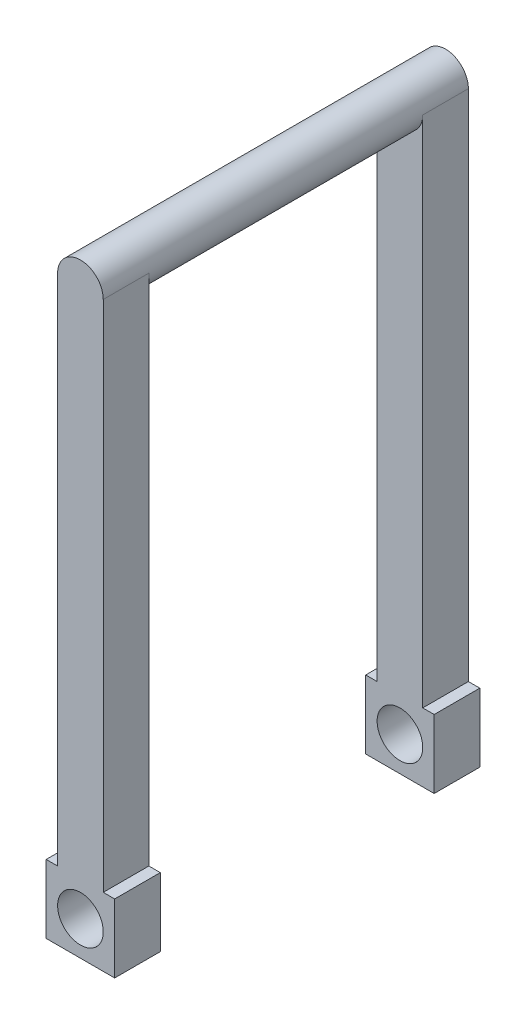
ISO-10303-21;
HEADER;
FILE_DESCRIPTION(('STEP AP214'),'2;1');
FILE_NAME('part.step','',(''),(''),'','','');
FILE_SCHEMA(('AUTOMOTIVE_DESIGN { 1 0 10303 214 1 1 1 1 }'));
ENDSEC;
DATA;
#1=APPLICATION_CONTEXT('core data for automotive mechanical design processes');
#2=APPLICATION_PROTOCOL_DEFINITION('international standard','automotive_design',2000,#1);
#3=PRODUCT_CONTEXT('',#1,'mechanical');
#4=PRODUCT('Part','Part','',(#3));
#5=PRODUCT_RELATED_PRODUCT_CATEGORY('part','',(#4));
#6=PRODUCT_DEFINITION_FORMATION('','',#4);
#7=PRODUCT_DEFINITION_CONTEXT('part definition',#1,'design');
#8=PRODUCT_DEFINITION('design','',#6,#7);
#9=PRODUCT_DEFINITION_SHAPE('','',#8);
#10=(LENGTH_UNIT() NAMED_UNIT(*) SI_UNIT(.MILLI.,.METRE.));
#11=(NAMED_UNIT(*) PLANE_ANGLE_UNIT() SI_UNIT($,.RADIAN.));
#12=(NAMED_UNIT(*) SI_UNIT($,.STERADIAN.) SOLID_ANGLE_UNIT());
#13=UNCERTAINTY_MEASURE_WITH_UNIT(LENGTH_MEASURE(1.E-05),#10,'distance_accuracy_value','');
#14=(GEOMETRIC_REPRESENTATION_CONTEXT(3) GLOBAL_UNCERTAINTY_ASSIGNED_CONTEXT((#13)) GLOBAL_UNIT_ASSIGNED_CONTEXT((#10,
#11,#12)) REPRESENTATION_CONTEXT('',''));
#15=CARTESIAN_POINT('',(0.,0.,0.));
#16=DIRECTION('',(0.,0.,1.));
#17=DIRECTION('',(1.,0.,0.));
#18=AXIS2_PLACEMENT_3D('',#15,#16,#17);
#19=CARTESIAN_POINT('',(9.52500000000001,-142.875,115.840768363207));
#20=DIRECTION('',(0.,1.,0.));
#21=DIRECTION('',(0.,0.,1.));
#22=AXIS2_PLACEMENT_3D('',#19,#20,#21);
#23=PLANE('',#22);
#24=DIRECTION('',(1.,0.,0.));
#25=VECTOR('',#24,1.);
#26=CARTESIAN_POINT('',(-188.595,-142.875,76.2));
#27=LINE('',#26,#25);
#28=CARTESIAN_POINT('',(-9.52500000000001,-142.875,76.2));
#29=VERTEX_POINT('',#28);
#30=CARTESIAN_POINT('',(-6.34999999999999,-142.875,76.2));
#31=VERTEX_POINT('',#30);
#32=EDGE_CURVE('E248',#29,#31,#27,.T.);
#33=ORIENTED_EDGE('',*,*,#32,.F.);
#34=DIRECTION('',(0.,0.,-1.));
#35=VECTOR('',#34,1.);
#36=CARTESIAN_POINT('',(-9.52499999999999,-142.875,115.840768363207));
#37=LINE('',#36,#35);
#38=CARTESIAN_POINT('',(-9.52499999999999,-142.875,88.9));
#39=VERTEX_POINT('',#38);
#40=EDGE_CURVE('E184',#39,#29,#37,.T.);
#41=ORIENTED_EDGE('',*,*,#40,.F.);
#42=DIRECTION('',(1.,0.,0.));
#43=VECTOR('',#42,1.);
#44=CARTESIAN_POINT('',(9.52500000000001,-142.875,88.9));
#45=LINE('',#44,#43);
#46=CARTESIAN_POINT('',(-6.35,-142.875,88.9));
#47=VERTEX_POINT('',#46);
#48=EDGE_CURVE('E174',#39,#47,#45,.T.);
#49=ORIENTED_EDGE('',*,*,#48,.T.);
#50=DIRECTION('',(0.,0.,1.));
#51=VECTOR('',#50,1.);
#52=CARTESIAN_POINT('',(-6.34999999999998,-142.875,88.9));
#53=LINE('',#52,#51);
#54=EDGE_CURVE('E195',#31,#47,#53,.T.);
#55=ORIENTED_EDGE('',*,*,#54,.F.);
#56=EDGE_LOOP('',(#33,#41,#49,#55));
#57=FACE_BOUND('',#56,.T.);
#58=ADVANCED_FACE('F38',(#57),#23,.T.);
#59=CARTESIAN_POINT('',(6.35000000000002,-142.875,76.2));
#60=VERTEX_POINT('',#59);
#61=CARTESIAN_POINT('',(9.52500000000001,-142.875,76.2));
#62=VERTEX_POINT('',#61);
#63=EDGE_CURVE('E274',#60,#62,#27,.T.);
#64=ORIENTED_EDGE('',*,*,#63,.F.);
#65=DIRECTION('',(0.,0.,-1.));
#66=VECTOR('',#65,1.);
#67=CARTESIAN_POINT('',(6.35000000000002,-142.875,88.9));
#68=LINE('',#67,#66);
#69=CARTESIAN_POINT('',(6.35000000000002,-142.875,88.9));
#70=VERTEX_POINT('',#69);
#71=EDGE_CURVE('E192',#70,#60,#68,.T.);
#72=ORIENTED_EDGE('',*,*,#71,.F.);
#73=CARTESIAN_POINT('',(9.52500000000001,-142.875,88.9));
#74=VERTEX_POINT('',#73);
#75=EDGE_CURVE('E178',#70,#74,#45,.T.);
#76=ORIENTED_EDGE('',*,*,#75,.T.);
#77=DIRECTION('',(0.,0.,-1.));
#78=VECTOR('',#77,1.);
#79=CARTESIAN_POINT('',(9.52500000000001,-142.875,115.840768363207));
#80=LINE('',#79,#78);
#81=EDGE_CURVE('E173',#74,#62,#80,.T.);
#82=ORIENTED_EDGE('',*,*,#81,.T.);
#83=EDGE_LOOP('',(#64,#72,#76,#82));
#84=FACE_BOUND('',#83,.T.);
#85=ADVANCED_FACE('F306',(#84),#23,.T.);
#86=DIRECTION('',(1.,0.,0.));
#87=VECTOR('',#86,1.);
#88=CARTESIAN_POINT('',(-188.595,-142.875,0.));
#89=LINE('',#88,#87);
#90=CARTESIAN_POINT('',(6.35000000000002,-142.875,0.));
#91=VERTEX_POINT('',#90);
#92=CARTESIAN_POINT('',(9.52500000000001,-142.875,0.));
#93=VERTEX_POINT('',#92);
#94=EDGE_CURVE('E152',#91,#93,#89,.T.);
#95=ORIENTED_EDGE('',*,*,#94,.T.);
#96=CARTESIAN_POINT('',(9.52500000000001,-142.875,-12.7));
#97=VERTEX_POINT('',#96);
#98=EDGE_CURVE('E163',#93,#97,#80,.T.);
#99=ORIENTED_EDGE('',*,*,#98,.T.);
#100=DIRECTION('',(1.,0.,0.));
#101=VECTOR('',#100,1.);
#102=CARTESIAN_POINT('',(9.52500000000001,-142.875,-12.7));
#103=LINE('',#102,#101);
#104=CARTESIAN_POINT('',(6.35000000000002,-142.875,-12.7));
#105=VERTEX_POINT('',#104);
#106=EDGE_CURVE('E266',#105,#97,#103,.T.);
#107=ORIENTED_EDGE('',*,*,#106,.F.);
#108=DIRECTION('',(0.,0.,-1.));
#109=VECTOR('',#108,1.);
#110=CARTESIAN_POINT('',(6.35000000000002,-142.875,-12.7));
#111=LINE('',#110,#109);
#112=EDGE_CURVE('E166',#91,#105,#111,.T.);
#113=ORIENTED_EDGE('',*,*,#112,.F.);
#114=EDGE_LOOP('',(#95,#99,#107,#113));
#115=FACE_BOUND('',#114,.T.);
#116=ADVANCED_FACE('F162',(#115),#23,.T.);
#117=CARTESIAN_POINT('',(9.52500000000001,-142.875,115.840768363207));
#118=DIRECTION('',(1.,0.,0.));
#119=DIRECTION('',(0.,1.,0.));
#120=AXIS2_PLACEMENT_3D('',#117,#118,#119);
#121=PLANE('',#120);
#122=DIRECTION('',(0.,-1.,0.));
#123=VECTOR('',#122,1.);
#124=CARTESIAN_POINT('',(9.52500000000001,-142.875,76.2));
#125=LINE('',#124,#123);
#126=CARTESIAN_POINT('',(9.52500000000001,-161.925,76.2));
#127=VERTEX_POINT('',#126);
#128=EDGE_CURVE('E159',#62,#127,#125,.T.);
#129=ORIENTED_EDGE('',*,*,#128,.F.);
#130=ORIENTED_EDGE('',*,*,#81,.F.);
#131=DIRECTION('',(0.,-1.,0.));
#132=VECTOR('',#131,1.);
#133=CARTESIAN_POINT('',(9.52500000000001,-142.875,88.9));
#134=LINE('',#133,#132);
#135=CARTESIAN_POINT('',(9.52500000000001,-161.925,88.9));
#136=VERTEX_POINT('',#135);
#137=EDGE_CURVE('E177',#74,#136,#134,.T.);
#138=ORIENTED_EDGE('',*,*,#137,.T.);
#139=DIRECTION('',(0.,0.,-1.));
#140=VECTOR('',#139,1.);
#141=CARTESIAN_POINT('',(9.52500000000001,-161.925,115.840768363207));
#142=LINE('',#141,#140);
#143=EDGE_CURVE('E182',#136,#127,#142,.T.);
#144=ORIENTED_EDGE('',*,*,#143,.T.);
#145=EDGE_LOOP('',(#129,#130,#138,#144));
#146=FACE_BOUND('',#145,.T.);
#147=ADVANCED_FACE('F323',(#146),#121,.T.);
#148=CARTESIAN_POINT('',(9.52500000000001,-161.925,115.840768363207));
#149=DIRECTION('',(0.,-1.,0.));
#150=DIRECTION('',(0.,0.,-1.));
#151=AXIS2_PLACEMENT_3D('',#148,#149,#150);
#152=PLANE('',#151);
#153=DIRECTION('',(-1.,0.,0.));
#154=VECTOR('',#153,1.);
#155=CARTESIAN_POINT('',(9.52500000000001,-161.925,76.2));
#156=LINE('',#155,#154);
#157=CARTESIAN_POINT('',(-9.525,-161.925,76.2));
#158=VERTEX_POINT('',#157);
#159=EDGE_CURVE('E60',#127,#158,#156,.T.);
#160=ORIENTED_EDGE('',*,*,#159,.F.);
#161=ORIENTED_EDGE('',*,*,#143,.F.);
#162=DIRECTION('',(-1.,0.,0.));
#163=VECTOR('',#162,1.);
#164=CARTESIAN_POINT('',(9.52500000000001,-161.925,88.9));
#165=LINE('',#164,#163);
#166=CARTESIAN_POINT('',(-9.525,-161.925,88.9));
#167=VERTEX_POINT('',#166);
#168=EDGE_CURVE('E255',#136,#167,#165,.T.);
#169=ORIENTED_EDGE('',*,*,#168,.T.);
#170=DIRECTION('',(0.,0.,-1.));
#171=VECTOR('',#170,1.);
#172=CARTESIAN_POINT('',(-9.525,-161.925,115.840768363207));
#173=LINE('',#172,#171);
#174=EDGE_CURVE('E254',#167,#158,#173,.T.);
#175=ORIENTED_EDGE('',*,*,#174,.T.);
#176=EDGE_LOOP('',(#160,#161,#169,#175));
#177=FACE_BOUND('',#176,.T.);
#178=ADVANCED_FACE('F329',(#177),#152,.T.);
#179=CARTESIAN_POINT('',(-9.52499999999999,-142.875,115.840768363207));
#180=DIRECTION('',(-1.,0.,0.));
#181=DIRECTION('',(0.,-1.,0.));
#182=AXIS2_PLACEMENT_3D('',#179,#180,#181);
#183=PLANE('',#182);
#184=DIRECTION('',(0.,1.,0.));
#185=VECTOR('',#184,1.);
#186=CARTESIAN_POINT('',(-9.52499999999999,-142.875,76.2));
#187=LINE('',#186,#185);
#188=EDGE_CURVE('E11',#158,#29,#187,.T.);
#189=ORIENTED_EDGE('',*,*,#188,.F.);
#190=ORIENTED_EDGE('',*,*,#174,.F.);
#191=DIRECTION('',(0.,1.,0.));
#192=VECTOR('',#191,1.);
#193=CARTESIAN_POINT('',(-9.52499999999999,-142.875,88.9));
#194=LINE('',#193,#192);
#195=EDGE_CURVE('E257',#167,#39,#194,.T.);
#196=ORIENTED_EDGE('',*,*,#195,.T.);
#197=ORIENTED_EDGE('',*,*,#40,.T.);
#198=EDGE_LOOP('',(#189,#190,#196,#197));
#199=FACE_BOUND('',#198,.T.);
#200=ADVANCED_FACE('F304',(#199),#183,.T.);
#201=CARTESIAN_POINT('',(0.,0.,76.2));
#202=DIRECTION('',(0.,0.,-1.));
#203=DIRECTION('',(-1.,0.,0.));
#204=AXIS2_PLACEMENT_3D('',#201,#202,#203);
#205=CYLINDRICAL_SURFACE('',#204,6.35);
#206=CARTESIAN_POINT('',(0.,0.,76.2));
#207=DIRECTION('',(0.,0.,1.));
#208=DIRECTION('',(1.,0.,0.));
#209=AXIS2_PLACEMENT_3D('',#206,#207,#208);
#210=CIRCLE('',#209,6.35);
#211=CARTESIAN_POINT('',(-6.35,0.,76.2));
#212=VERTEX_POINT('',#211);
#213=CARTESIAN_POINT('',(6.35,0.,76.2));
#214=VERTEX_POINT('',#213);
#215=EDGE_CURVE('E236',#212,#214,#210,.T.);
#216=ORIENTED_EDGE('',*,*,#215,.F.);
#217=DIRECTION('',(0.,0.,-1.));
#218=VECTOR('',#217,1.);
#219=CARTESIAN_POINT('',(-6.35,0.,88.9));
#220=LINE('',#219,#218);
#221=CARTESIAN_POINT('',(-6.35,0.,88.9));
#222=VERTEX_POINT('',#221);
#223=EDGE_CURVE('E226',#222,#212,#220,.T.);
#224=ORIENTED_EDGE('',*,*,#223,.F.);
#225=CARTESIAN_POINT('',(0.,0.,88.9));
#226=DIRECTION('',(0.,0.,1.));
#227=DIRECTION('',(1.,0.,0.));
#228=AXIS2_PLACEMENT_3D('',#225,#226,#227);
#229=CIRCLE('',#228,6.35);
#230=CARTESIAN_POINT('',(6.35,0.,88.9));
#231=VERTEX_POINT('',#230);
#232=EDGE_CURVE('E216',#231,#222,#229,.T.);
#233=ORIENTED_EDGE('',*,*,#232,.F.);
#234=DIRECTION('',(0.,0.,-1.));
#235=VECTOR('',#234,1.);
#236=CARTESIAN_POINT('',(6.35,0.,88.9));
#237=LINE('',#236,#235);
#238=EDGE_CURVE('E232',#231,#214,#237,.T.);
#239=ORIENTED_EDGE('',*,*,#238,.T.);
#240=EDGE_LOOP('',(#216,#224,#233,#239));
#241=FACE_BOUND('',#240,.T.);
#242=CARTESIAN_POINT('',(0.,0.,0.));
#243=DIRECTION('',(0.,0.,1.));
#244=DIRECTION('',(1.,0.,0.));
#245=AXIS2_PLACEMENT_3D('',#242,#243,#244);
#246=CIRCLE('',#245,6.35);
#247=CARTESIAN_POINT('',(-6.35,0.,0.));
#248=VERTEX_POINT('',#247);
#249=CARTESIAN_POINT('',(6.35,0.,0.));
#250=VERTEX_POINT('',#249);
#251=EDGE_CURVE('E235',#248,#250,#246,.T.);
#252=ORIENTED_EDGE('',*,*,#251,.T.);
#253=DIRECTION('',(0.,0.,1.));
#254=VECTOR('',#253,1.);
#255=CARTESIAN_POINT('',(6.35,0.,-12.7));
#256=LINE('',#255,#254);
#257=CARTESIAN_POINT('',(6.35,0.,-12.7));
#258=VERTEX_POINT('',#257);
#259=EDGE_CURVE('E208',#258,#250,#256,.T.);
#260=ORIENTED_EDGE('',*,*,#259,.F.);
#261=CARTESIAN_POINT('',(0.,0.,-12.7));
#262=DIRECTION('',(0.,0.,-1.));
#263=DIRECTION('',(-1.,0.,0.));
#264=AXIS2_PLACEMENT_3D('',#261,#262,#263);
#265=CIRCLE('',#264,6.35);
#266=CARTESIAN_POINT('',(-6.35,0.,-12.7));
#267=VERTEX_POINT('',#266);
#268=EDGE_CURVE('E198',#267,#258,#265,.T.);
#269=ORIENTED_EDGE('',*,*,#268,.F.);
#270=DIRECTION('',(0.,0.,1.));
#271=VECTOR('',#270,1.);
#272=CARTESIAN_POINT('',(-6.35,0.,-12.7));
#273=LINE('',#272,#271);
#274=EDGE_CURVE('E213',#267,#248,#273,.T.);
#275=ORIENTED_EDGE('',*,*,#274,.T.);
#276=EDGE_LOOP('',(#252,#260,#269,#275));
#277=FACE_BOUND('',#276,.T.);
#278=ADVANCED_FACE('F40',(#241,#277),#205,.T.);
#279=CARTESIAN_POINT('',(0.,0.,76.2));
#280=DIRECTION('',(0.,0.,1.));
#281=DIRECTION('',(1.,0.,0.));
#282=AXIS2_PLACEMENT_3D('',#279,#280,#281);
#283=PLANE('',#282);
#284=CARTESIAN_POINT('',(0.,-152.4,76.2));
#285=DIRECTION('',(0.,0.,1.));
#286=DIRECTION('',(1.,0.,0.));
#287=AXIS2_PLACEMENT_3D('',#284,#285,#286);
#288=CIRCLE('',#287,6.35);
#289=CARTESIAN_POINT('',(6.35,-152.4,76.2));
#290=VERTEX_POINT('',#289);
#291=EDGE_CURVE('E277',#290,#290,#288,.T.);
#292=ORIENTED_EDGE('',*,*,#291,.T.);
#293=EDGE_LOOP('',(#292));
#294=FACE_BOUND('',#293,.T.);
#295=DIRECTION('',(0.,1.,0.));
#296=VECTOR('',#295,1.);
#297=CARTESIAN_POINT('',(6.35,0.,76.2));
#298=LINE('',#297,#296);
#299=EDGE_CURVE('E224',#60,#214,#298,.T.);
#300=ORIENTED_EDGE('',*,*,#299,.F.);
#301=ORIENTED_EDGE('',*,*,#63,.T.);
#302=ORIENTED_EDGE('',*,*,#128,.T.);
#303=ORIENTED_EDGE('',*,*,#159,.T.);
#304=ORIENTED_EDGE('',*,*,#188,.T.);
#305=ORIENTED_EDGE('',*,*,#32,.T.);
#306=DIRECTION('',(0.,-1.,0.));
#307=VECTOR('',#306,1.);
#308=CARTESIAN_POINT('',(-6.35,0.,76.2));
#309=LINE('',#308,#307);
#310=EDGE_CURVE('E219',#212,#31,#309,.T.);
#311=ORIENTED_EDGE('',*,*,#310,.F.);
#312=ORIENTED_EDGE('',*,*,#215,.T.);
#313=EDGE_LOOP('',(#300,#301,#302,#303,#304,#305,#311,#312));
#314=FACE_BOUND('',#313,.T.);
#315=ADVANCED_FACE('F352',(#294,#314),#283,.F.);
#316=CARTESIAN_POINT('',(-6.35,0.,88.9));
#317=DIRECTION('',(1.,0.,0.));
#318=DIRECTION('',(0.,1.,0.));
#319=AXIS2_PLACEMENT_3D('',#316,#317,#318);
#320=PLANE('',#319);
#321=ORIENTED_EDGE('',*,*,#310,.T.);
#322=ORIENTED_EDGE('',*,*,#54,.T.);
#323=DIRECTION('',(0.,-1.,0.));
#324=VECTOR('',#323,1.);
#325=CARTESIAN_POINT('',(-6.35,0.,88.9));
#326=LINE('',#325,#324);
#327=EDGE_CURVE('E220',#222,#47,#326,.T.);
#328=ORIENTED_EDGE('',*,*,#327,.F.);
#329=ORIENTED_EDGE('',*,*,#223,.T.);
#330=EDGE_LOOP('',(#321,#322,#328,#329));
#331=FACE_BOUND('',#330,.T.);
#332=ADVANCED_FACE('F357',(#331),#320,.F.);
#333=CARTESIAN_POINT('',(6.35,0.,88.9));
#334=DIRECTION('',(-1.,0.,0.));
#335=DIRECTION('',(0.,-1.,0.));
#336=AXIS2_PLACEMENT_3D('',#333,#334,#335);
#337=PLANE('',#336);
#338=DIRECTION('',(0.,1.,0.));
#339=VECTOR('',#338,1.);
#340=CARTESIAN_POINT('',(6.35,0.,88.9));
#341=LINE('',#340,#339);
#342=EDGE_CURVE('E223',#70,#231,#341,.T.);
#343=ORIENTED_EDGE('',*,*,#342,.F.);
#344=ORIENTED_EDGE('',*,*,#71,.T.);
#345=ORIENTED_EDGE('',*,*,#299,.T.);
#346=ORIENTED_EDGE('',*,*,#238,.F.);
#347=EDGE_LOOP('',(#343,#344,#345,#346));
#348=FACE_BOUND('',#347,.T.);
#349=ADVANCED_FACE('F373',(#348),#337,.F.);
#350=CARTESIAN_POINT('',(0.,0.,88.9));
#351=DIRECTION('',(0.,0.,1.));
#352=DIRECTION('',(1.,0.,0.));
#353=AXIS2_PLACEMENT_3D('',#350,#351,#352);
#354=PLANE('',#353);
#355=CARTESIAN_POINT('',(0.,-152.4,88.9));
#356=DIRECTION('',(0.,0.,1.));
#357=DIRECTION('',(1.,0.,0.));
#358=AXIS2_PLACEMENT_3D('',#355,#356,#357);
#359=CIRCLE('',#358,6.35);
#360=CARTESIAN_POINT('',(6.35,-152.4,88.9));
#361=VERTEX_POINT('',#360);
#362=EDGE_CURVE('E284',#361,#361,#359,.T.);
#363=ORIENTED_EDGE('',*,*,#362,.F.);
#364=EDGE_LOOP('',(#363));
#365=FACE_BOUND('',#364,.T.);
#366=ORIENTED_EDGE('',*,*,#327,.T.);
#367=ORIENTED_EDGE('',*,*,#48,.F.);
#368=ORIENTED_EDGE('',*,*,#195,.F.);
#369=ORIENTED_EDGE('',*,*,#168,.F.);
#370=ORIENTED_EDGE('',*,*,#137,.F.);
#371=ORIENTED_EDGE('',*,*,#75,.F.);
#372=ORIENTED_EDGE('',*,*,#342,.T.);
#373=ORIENTED_EDGE('',*,*,#232,.T.);
#374=EDGE_LOOP('',(#366,#367,#368,#369,#370,#371,#372,#373));
#375=FACE_BOUND('',#374,.T.);
#376=ADVANCED_FACE('F368',(#365,#375),#354,.T.);
#377=CARTESIAN_POINT('',(0.,0.,0.));
#378=DIRECTION('',(0.,0.,1.));
#379=DIRECTION('',(1.,0.,0.));
#380=AXIS2_PLACEMENT_3D('',#377,#378,#379);
#381=PLANE('',#380);
#382=CARTESIAN_POINT('',(0.,-152.4,0.));
#383=DIRECTION('',(0.,0.,1.));
#384=DIRECTION('',(1.,0.,0.));
#385=AXIS2_PLACEMENT_3D('',#382,#383,#384);
#386=CIRCLE('',#385,6.35);
#387=CARTESIAN_POINT('',(6.35,-152.4,0.));
#388=VERTEX_POINT('',#387);
#389=EDGE_CURVE('E280',#388,#388,#386,.T.);
#390=ORIENTED_EDGE('',*,*,#389,.F.);
#391=EDGE_LOOP('',(#390));
#392=FACE_BOUND('',#391,.T.);
#393=DIRECTION('',(0.,1.,0.));
#394=VECTOR('',#393,1.);
#395=CARTESIAN_POINT('',(-6.35,0.,0.));
#396=LINE('',#395,#394);
#397=CARTESIAN_POINT('',(-6.34999999999999,-142.875,0.));
#398=VERTEX_POINT('',#397);
#399=EDGE_CURVE('E206',#398,#248,#396,.T.);
#400=ORIENTED_EDGE('',*,*,#399,.F.);
#401=CARTESIAN_POINT('',(-9.52499999999999,-142.875,0.));
#402=VERTEX_POINT('',#401);
#403=EDGE_CURVE('E53',#402,#398,#89,.T.);
#404=ORIENTED_EDGE('',*,*,#403,.F.);
#405=DIRECTION('',(0.,-1.,0.));
#406=VECTOR('',#405,1.);
#407=CARTESIAN_POINT('',(-9.52499999999999,-142.875,0.));
#408=LINE('',#407,#406);
#409=CARTESIAN_POINT('',(-9.525,-161.925,0.));
#410=VERTEX_POINT('',#409);
#411=EDGE_CURVE('E46',#402,#410,#408,.T.);
#412=ORIENTED_EDGE('',*,*,#411,.T.);
#413=DIRECTION('',(1.,0.,0.));
#414=VECTOR('',#413,1.);
#415=CARTESIAN_POINT('',(9.52500000000001,-161.925,0.));
#416=LINE('',#415,#414);
#417=CARTESIAN_POINT('',(9.52500000000001,-161.925,0.));
#418=VERTEX_POINT('',#417);
#419=EDGE_CURVE('E155',#410,#418,#416,.T.);
#420=ORIENTED_EDGE('',*,*,#419,.T.);
#421=DIRECTION('',(0.,1.,0.));
#422=VECTOR('',#421,1.);
#423=CARTESIAN_POINT('',(9.52500000000001,-142.875,0.));
#424=LINE('',#423,#422);
#425=EDGE_CURVE('E148',#418,#93,#424,.T.);
#426=ORIENTED_EDGE('',*,*,#425,.T.);
#427=ORIENTED_EDGE('',*,*,#94,.F.);
#428=DIRECTION('',(0.,-1.,0.));
#429=VECTOR('',#428,1.);
#430=CARTESIAN_POINT('',(6.35000000000002,-152.4,0.));
#431=LINE('',#430,#429);
#432=EDGE_CURVE('E201',#250,#91,#431,.T.);
#433=ORIENTED_EDGE('',*,*,#432,.F.);
#434=ORIENTED_EDGE('',*,*,#251,.F.);
#435=EDGE_LOOP('',(#400,#404,#412,#420,#426,#427,#433,#434));
#436=FACE_BOUND('',#435,.T.);
#437=ADVANCED_FACE('F150',(#392,#436),#381,.T.);
#438=CARTESIAN_POINT('',(6.35000000000002,-152.4,-12.7));
#439=DIRECTION('',(-1.,0.,0.));
#440=DIRECTION('',(0.,-1.,0.));
#441=AXIS2_PLACEMENT_3D('',#438,#439,#440);
#442=PLANE('',#441);
#443=ORIENTED_EDGE('',*,*,#432,.T.);
#444=ORIENTED_EDGE('',*,*,#112,.T.);
#445=DIRECTION('',(0.,-1.,0.));
#446=VECTOR('',#445,1.);
#447=CARTESIAN_POINT('',(6.35000000000002,-152.4,-12.7));
#448=LINE('',#447,#446);
#449=EDGE_CURVE('E202',#258,#105,#448,.T.);
#450=ORIENTED_EDGE('',*,*,#449,.F.);
#451=ORIENTED_EDGE('',*,*,#259,.T.);
#452=EDGE_LOOP('',(#443,#444,#450,#451));
#453=FACE_BOUND('',#452,.T.);
#454=ADVANCED_FACE('F386',(#453),#442,.F.);
#455=CARTESIAN_POINT('',(-6.35,0.,-12.7));
#456=DIRECTION('',(1.,0.,0.));
#457=DIRECTION('',(0.,1.,0.));
#458=AXIS2_PLACEMENT_3D('',#455,#456,#457);
#459=PLANE('',#458);
#460=DIRECTION('',(0.,1.,0.));
#461=VECTOR('',#460,1.);
#462=CARTESIAN_POINT('',(-6.35,0.,-12.7));
#463=LINE('',#462,#461);
#464=CARTESIAN_POINT('',(-6.34999999999999,-142.875,-12.7));
#465=VERTEX_POINT('',#464);
#466=EDGE_CURVE('E205',#465,#267,#463,.T.);
#467=ORIENTED_EDGE('',*,*,#466,.F.);
#468=DIRECTION('',(0.,0.,1.));
#469=VECTOR('',#468,1.);
#470=CARTESIAN_POINT('',(-6.34999999999998,-142.875,-12.7));
#471=LINE('',#470,#469);
#472=EDGE_CURVE('E187',#465,#398,#471,.T.);
#473=ORIENTED_EDGE('',*,*,#472,.T.);
#474=ORIENTED_EDGE('',*,*,#399,.T.);
#475=ORIENTED_EDGE('',*,*,#274,.F.);
#476=EDGE_LOOP('',(#467,#473,#474,#475));
#477=FACE_BOUND('',#476,.T.);
#478=ADVANCED_FACE('F324',(#477),#459,.F.);
#479=CARTESIAN_POINT('',(0.,0.,-12.7));
#480=DIRECTION('',(0.,0.,1.));
#481=DIRECTION('',(1.,0.,0.));
#482=AXIS2_PLACEMENT_3D('',#479,#480,#481);
#483=PLANE('',#482);
#484=CARTESIAN_POINT('',(0.,-152.4,-12.7));
#485=DIRECTION('',(0.,0.,1.));
#486=DIRECTION('',(1.,0.,0.));
#487=AXIS2_PLACEMENT_3D('',#484,#485,#486);
#488=CIRCLE('',#487,6.35);
#489=CARTESIAN_POINT('',(6.35,-152.4,-12.7));
#490=VERTEX_POINT('',#489);
#491=EDGE_CURVE('E283',#490,#490,#488,.T.);
#492=ORIENTED_EDGE('',*,*,#491,.T.);
#493=EDGE_LOOP('',(#492));
#494=FACE_BOUND('',#493,.T.);
#495=ORIENTED_EDGE('',*,*,#449,.T.);
#496=ORIENTED_EDGE('',*,*,#106,.T.);
#497=DIRECTION('',(0.,-1.,0.));
#498=VECTOR('',#497,1.);
#499=CARTESIAN_POINT('',(9.52500000000001,-142.875,-12.7));
#500=LINE('',#499,#498);
#501=CARTESIAN_POINT('',(9.52500000000001,-161.925,-12.7));
#502=VERTEX_POINT('',#501);
#503=EDGE_CURVE('E172',#97,#502,#500,.T.);
#504=ORIENTED_EDGE('',*,*,#503,.T.);
#505=DIRECTION('',(-1.,0.,0.));
#506=VECTOR('',#505,1.);
#507=CARTESIAN_POINT('',(9.52500000000001,-161.925,-12.7));
#508=LINE('',#507,#506);
#509=CARTESIAN_POINT('',(-9.525,-161.925,-12.7));
#510=VERTEX_POINT('',#509);
#511=EDGE_CURVE('E271',#502,#510,#508,.T.);
#512=ORIENTED_EDGE('',*,*,#511,.T.);
#513=DIRECTION('',(0.,1.,0.));
#514=VECTOR('',#513,1.);
#515=CARTESIAN_POINT('',(-9.52499999999999,-142.875,-12.7));
#516=LINE('',#515,#514);
#517=CARTESIAN_POINT('',(-9.52499999999999,-142.875,-12.7));
#518=VERTEX_POINT('',#517);
#519=EDGE_CURVE('E252',#510,#518,#516,.T.);
#520=ORIENTED_EDGE('',*,*,#519,.T.);
#521=EDGE_CURVE('E267',#518,#465,#103,.T.);
#522=ORIENTED_EDGE('',*,*,#521,.T.);
#523=ORIENTED_EDGE('',*,*,#466,.T.);
#524=ORIENTED_EDGE('',*,*,#268,.T.);
#525=EDGE_LOOP('',(#495,#496,#504,#512,#520,#522,#523,#524));
#526=FACE_BOUND('',#525,.T.);
#527=ADVANCED_FACE('F290',(#494,#526),#483,.F.);
#528=ORIENTED_EDGE('',*,*,#403,.T.);
#529=ORIENTED_EDGE('',*,*,#472,.F.);
#530=ORIENTED_EDGE('',*,*,#521,.F.);
#531=EDGE_CURVE('E188',#402,#518,#37,.T.);
#532=ORIENTED_EDGE('',*,*,#531,.F.);
#533=EDGE_LOOP('',(#528,#529,#530,#532));
#534=FACE_BOUND('',#533,.T.);
#535=ADVANCED_FACE('F309',(#534),#23,.T.);
#536=ORIENTED_EDGE('',*,*,#425,.F.);
#537=EDGE_CURVE('E247',#418,#502,#142,.T.);
#538=ORIENTED_EDGE('',*,*,#537,.T.);
#539=ORIENTED_EDGE('',*,*,#503,.F.);
#540=ORIENTED_EDGE('',*,*,#98,.F.);
#541=EDGE_LOOP('',(#536,#538,#539,#540));
#542=FACE_BOUND('',#541,.T.);
#543=ADVANCED_FACE('F170',(#542),#121,.T.);
#544=ORIENTED_EDGE('',*,*,#419,.F.);
#545=EDGE_CURVE('E245',#410,#510,#173,.T.);
#546=ORIENTED_EDGE('',*,*,#545,.T.);
#547=ORIENTED_EDGE('',*,*,#511,.F.);
#548=ORIENTED_EDGE('',*,*,#537,.F.);
#549=EDGE_LOOP('',(#544,#546,#547,#548));
#550=FACE_BOUND('',#549,.T.);
#551=ADVANCED_FACE('F243',(#550),#152,.T.);
#552=ORIENTED_EDGE('',*,*,#411,.F.);
#553=ORIENTED_EDGE('',*,*,#531,.T.);
#554=ORIENTED_EDGE('',*,*,#519,.F.);
#555=ORIENTED_EDGE('',*,*,#545,.F.);
#556=EDGE_LOOP('',(#552,#553,#554,#555));
#557=FACE_BOUND('',#556,.T.);
#558=ADVANCED_FACE('F250',(#557),#183,.T.);
#559=CARTESIAN_POINT('',(0.,-152.4,-12.7));
#560=DIRECTION('',(0.,0.,1.));
#561=DIRECTION('',(1.,0.,0.));
#562=AXIS2_PLACEMENT_3D('',#559,#560,#561);
#563=CYLINDRICAL_SURFACE('',#562,6.35);
#564=ORIENTED_EDGE('',*,*,#389,.T.);
#565=EDGE_LOOP('',(#564));
#566=FACE_BOUND('',#565,.T.);
#567=ORIENTED_EDGE('',*,*,#491,.F.);
#568=EDGE_LOOP('',(#567));
#569=FACE_BOUND('',#568,.T.);
#570=ADVANCED_FACE('F293',(#566,#569),#563,.F.);
#571=ORIENTED_EDGE('',*,*,#362,.T.);
#572=EDGE_LOOP('',(#571));
#573=FACE_BOUND('',#572,.T.);
#574=ORIENTED_EDGE('',*,*,#291,.F.);
#575=EDGE_LOOP('',(#574));
#576=FACE_BOUND('',#575,.T.);
#577=ADVANCED_FACE('F295',(#573,#576),#563,.F.);
#578=CLOSED_SHELL('',(#58,#85,#116,#147,#178,#200,#278,#315,#332,#349,#376,#437,#454,#478,#527,
#535,#543,#551,#558,#570,#577));
#579=MANIFOLD_SOLID_BREP('B2',#578);
#580=ADVANCED_BREP_SHAPE_REPRESENTATION('',(#18,#579),#14);
#581=SHAPE_DEFINITION_REPRESENTATION(#9,#580);
ENDSEC;
END-ISO-10303-21;
